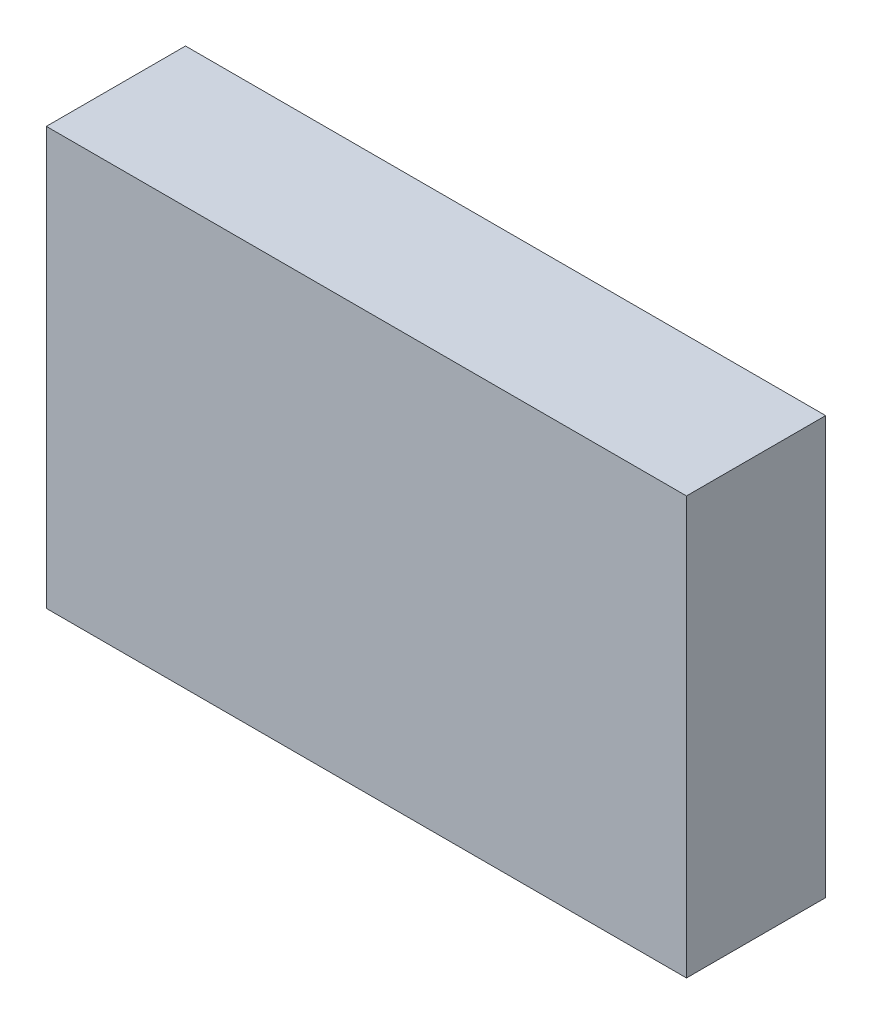
ISO-10303-21;
HEADER;
FILE_DESCRIPTION(('STEP AP214'),'2;1');
FILE_NAME('part.step','',(''),(''),'','','');
FILE_SCHEMA(('AUTOMOTIVE_DESIGN { 1 0 10303 214 1 1 1 1 }'));
ENDSEC;
DATA;
#1=APPLICATION_CONTEXT('core data for automotive mechanical design processes');
#2=APPLICATION_PROTOCOL_DEFINITION('international standard','automotive_design',2000,#1);
#3=PRODUCT_CONTEXT('',#1,'mechanical');
#4=PRODUCT('Part','Part','',(#3));
#5=PRODUCT_RELATED_PRODUCT_CATEGORY('part','',(#4));
#6=PRODUCT_DEFINITION_FORMATION('','',#4);
#7=PRODUCT_DEFINITION_CONTEXT('part definition',#1,'design');
#8=PRODUCT_DEFINITION('design','',#6,#7);
#9=PRODUCT_DEFINITION_SHAPE('','',#8);
#10=(LENGTH_UNIT() NAMED_UNIT(*) SI_UNIT(.MILLI.,.METRE.));
#11=(NAMED_UNIT(*) PLANE_ANGLE_UNIT() SI_UNIT($,.RADIAN.));
#12=(NAMED_UNIT(*) SI_UNIT($,.STERADIAN.) SOLID_ANGLE_UNIT());
#13=UNCERTAINTY_MEASURE_WITH_UNIT(LENGTH_MEASURE(1.E-05),#10,'distance_accuracy_value','');
#14=(GEOMETRIC_REPRESENTATION_CONTEXT(3) GLOBAL_UNCERTAINTY_ASSIGNED_CONTEXT((#13)) GLOBAL_UNIT_ASSIGNED_CONTEXT((#10,
#11,#12)) REPRESENTATION_CONTEXT('',''));
#15=CARTESIAN_POINT('',(0.,0.,0.));
#16=DIRECTION('',(0.,0.,1.));
#17=DIRECTION('',(1.,0.,0.));
#18=AXIS2_PLACEMENT_3D('',#15,#16,#17);
#19=CARTESIAN_POINT('',(-46.,30.,20.));
#20=DIRECTION('',(1.,0.,0.));
#21=DIRECTION('',(0.,1.,0.));
#22=AXIS2_PLACEMENT_3D('',#19,#20,#21);
#23=PLANE('',#22);
#24=DIRECTION('',(0.,-1.,0.));
#25=VECTOR('',#24,1.);
#26=CARTESIAN_POINT('',(-46.,30.,0.));
#27=LINE('',#26,#25);
#28=CARTESIAN_POINT('',(-46.,30.,0.));
#29=VERTEX_POINT('',#28);
#30=CARTESIAN_POINT('',(-46.,-30.,0.));
#31=VERTEX_POINT('',#30);
#32=EDGE_CURVE('E97',#29,#31,#27,.T.);
#33=ORIENTED_EDGE('',*,*,#32,.T.);
#34=DIRECTION('',(0.,0.,-1.));
#35=VECTOR('',#34,1.);
#36=CARTESIAN_POINT('',(-46.,-30.,20.));
#37=LINE('',#36,#35);
#38=CARTESIAN_POINT('',(-46.,-30.,20.));
#39=VERTEX_POINT('',#38);
#40=EDGE_CURVE('E11',#39,#31,#37,.T.);
#41=ORIENTED_EDGE('',*,*,#40,.F.);
#42=DIRECTION('',(0.,-1.,0.));
#43=VECTOR('',#42,1.);
#44=CARTESIAN_POINT('',(-46.,30.,20.));
#45=LINE('',#44,#43);
#46=CARTESIAN_POINT('',(-46.,30.,20.));
#47=VERTEX_POINT('',#46);
#48=EDGE_CURVE('E85',#47,#39,#45,.T.);
#49=ORIENTED_EDGE('',*,*,#48,.F.);
#50=DIRECTION('',(0.,0.,-1.));
#51=VECTOR('',#50,1.);
#52=CARTESIAN_POINT('',(-46.,30.,20.));
#53=LINE('',#52,#51);
#54=EDGE_CURVE('E93',#47,#29,#53,.T.);
#55=ORIENTED_EDGE('',*,*,#54,.T.);
#56=EDGE_LOOP('',(#33,#41,#49,#55));
#57=FACE_BOUND('',#56,.T.);
#58=ADVANCED_FACE('F34',(#57),#23,.F.);
#59=CARTESIAN_POINT('',(-46.,-30.,20.));
#60=DIRECTION('',(0.,1.,0.));
#61=DIRECTION('',(-1.,0.,0.));
#62=AXIS2_PLACEMENT_3D('',#59,#60,#61);
#63=PLANE('',#62);
#64=DIRECTION('',(1.,0.,0.));
#65=VECTOR('',#64,1.);
#66=CARTESIAN_POINT('',(-46.,-30.,0.));
#67=LINE('',#66,#65);
#68=CARTESIAN_POINT('',(46.,-30.,0.));
#69=VERTEX_POINT('',#68);
#70=EDGE_CURVE('E89',#31,#69,#67,.T.);
#71=ORIENTED_EDGE('',*,*,#70,.T.);
#72=DIRECTION('',(0.,0.,-1.));
#73=VECTOR('',#72,1.);
#74=CARTESIAN_POINT('',(46.,-30.,20.));
#75=LINE('',#74,#73);
#76=CARTESIAN_POINT('',(46.,-30.,20.));
#77=VERTEX_POINT('',#76);
#78=EDGE_CURVE('E42',#77,#69,#75,.T.);
#79=ORIENTED_EDGE('',*,*,#78,.F.);
#80=DIRECTION('',(1.,0.,0.));
#81=VECTOR('',#80,1.);
#82=CARTESIAN_POINT('',(-46.,-30.,20.));
#83=LINE('',#82,#81);
#84=EDGE_CURVE('E80',#39,#77,#83,.T.);
#85=ORIENTED_EDGE('',*,*,#84,.F.);
#86=ORIENTED_EDGE('',*,*,#40,.T.);
#87=EDGE_LOOP('',(#71,#79,#85,#86));
#88=FACE_BOUND('',#87,.T.);
#89=ADVANCED_FACE('F88',(#88),#63,.F.);
#90=CARTESIAN_POINT('',(46.,30.,20.));
#91=DIRECTION('',(-1.,0.,0.));
#92=DIRECTION('',(0.,-1.,0.));
#93=AXIS2_PLACEMENT_3D('',#90,#91,#92);
#94=PLANE('',#93);
#95=DIRECTION('',(0.,1.,0.));
#96=VECTOR('',#95,1.);
#97=CARTESIAN_POINT('',(46.,30.,0.));
#98=LINE('',#97,#96);
#99=CARTESIAN_POINT('',(46.,30.,0.));
#100=VERTEX_POINT('',#99);
#101=EDGE_CURVE('E67',#69,#100,#98,.T.);
#102=ORIENTED_EDGE('',*,*,#101,.T.);
#103=DIRECTION('',(0.,0.,-1.));
#104=VECTOR('',#103,1.);
#105=CARTESIAN_POINT('',(46.,30.,20.));
#106=LINE('',#105,#104);
#107=CARTESIAN_POINT('',(46.,30.,20.));
#108=VERTEX_POINT('',#107);
#109=EDGE_CURVE('E90',#108,#100,#106,.T.);
#110=ORIENTED_EDGE('',*,*,#109,.F.);
#111=DIRECTION('',(0.,1.,0.));
#112=VECTOR('',#111,1.);
#113=CARTESIAN_POINT('',(46.,30.,20.));
#114=LINE('',#113,#112);
#115=EDGE_CURVE('E83',#77,#108,#114,.T.);
#116=ORIENTED_EDGE('',*,*,#115,.F.);
#117=ORIENTED_EDGE('',*,*,#78,.T.);
#118=EDGE_LOOP('',(#102,#110,#116,#117));
#119=FACE_BOUND('',#118,.T.);
#120=ADVANCED_FACE('F91',(#119),#94,.F.);
#121=CARTESIAN_POINT('',(-46.,30.,20.));
#122=DIRECTION('',(0.,-1.,0.));
#123=DIRECTION('',(0.,0.,-1.));
#124=AXIS2_PLACEMENT_3D('',#121,#122,#123);
#125=PLANE('',#124);
#126=DIRECTION('',(-1.,0.,0.));
#127=VECTOR('',#126,1.);
#128=CARTESIAN_POINT('',(-46.,30.,0.));
#129=LINE('',#128,#127);
#130=EDGE_CURVE('E73',#100,#29,#129,.T.);
#131=ORIENTED_EDGE('',*,*,#130,.T.);
#132=ORIENTED_EDGE('',*,*,#54,.F.);
#133=DIRECTION('',(-1.,0.,0.));
#134=VECTOR('',#133,1.);
#135=CARTESIAN_POINT('',(-46.,30.,20.));
#136=LINE('',#135,#134);
#137=EDGE_CURVE('E50',#108,#47,#136,.T.);
#138=ORIENTED_EDGE('',*,*,#137,.F.);
#139=ORIENTED_EDGE('',*,*,#109,.T.);
#140=EDGE_LOOP('',(#131,#132,#138,#139));
#141=FACE_BOUND('',#140,.T.);
#142=ADVANCED_FACE('F104',(#141),#125,.F.);
#143=CARTESIAN_POINT('',(0.,0.,20.));
#144=DIRECTION('',(0.,0.,1.));
#145=DIRECTION('',(1.,0.,0.));
#146=AXIS2_PLACEMENT_3D('',#143,#144,#145);
#147=PLANE('',#146);
#148=ORIENTED_EDGE('',*,*,#48,.T.);
#149=ORIENTED_EDGE('',*,*,#84,.T.);
#150=ORIENTED_EDGE('',*,*,#115,.T.);
#151=ORIENTED_EDGE('',*,*,#137,.T.);
#152=EDGE_LOOP('',(#148,#149,#150,#151));
#153=FACE_BOUND('',#152,.T.);
#154=ADVANCED_FACE('F81',(#153),#147,.T.);
#155=CARTESIAN_POINT('',(0.,0.,0.));
#156=DIRECTION('',(0.,0.,1.));
#157=DIRECTION('',(1.,0.,0.));
#158=AXIS2_PLACEMENT_3D('',#155,#156,#157);
#159=PLANE('',#158);
#160=ORIENTED_EDGE('',*,*,#32,.F.);
#161=ORIENTED_EDGE('',*,*,#130,.F.);
#162=ORIENTED_EDGE('',*,*,#101,.F.);
#163=ORIENTED_EDGE('',*,*,#70,.F.);
#164=EDGE_LOOP('',(#160,#161,#162,#163));
#165=FACE_BOUND('',#164,.T.);
#166=ADVANCED_FACE('F107',(#165),#159,.F.);
#167=CLOSED_SHELL('',(#58,#89,#120,#142,#154,#166));
#168=MANIFOLD_SOLID_BREP('B2',#167);
#169=ADVANCED_BREP_SHAPE_REPRESENTATION('',(#18,#168),#14);
#170=SHAPE_DEFINITION_REPRESENTATION(#9,#169);
ENDSEC;
END-ISO-10303-21;
